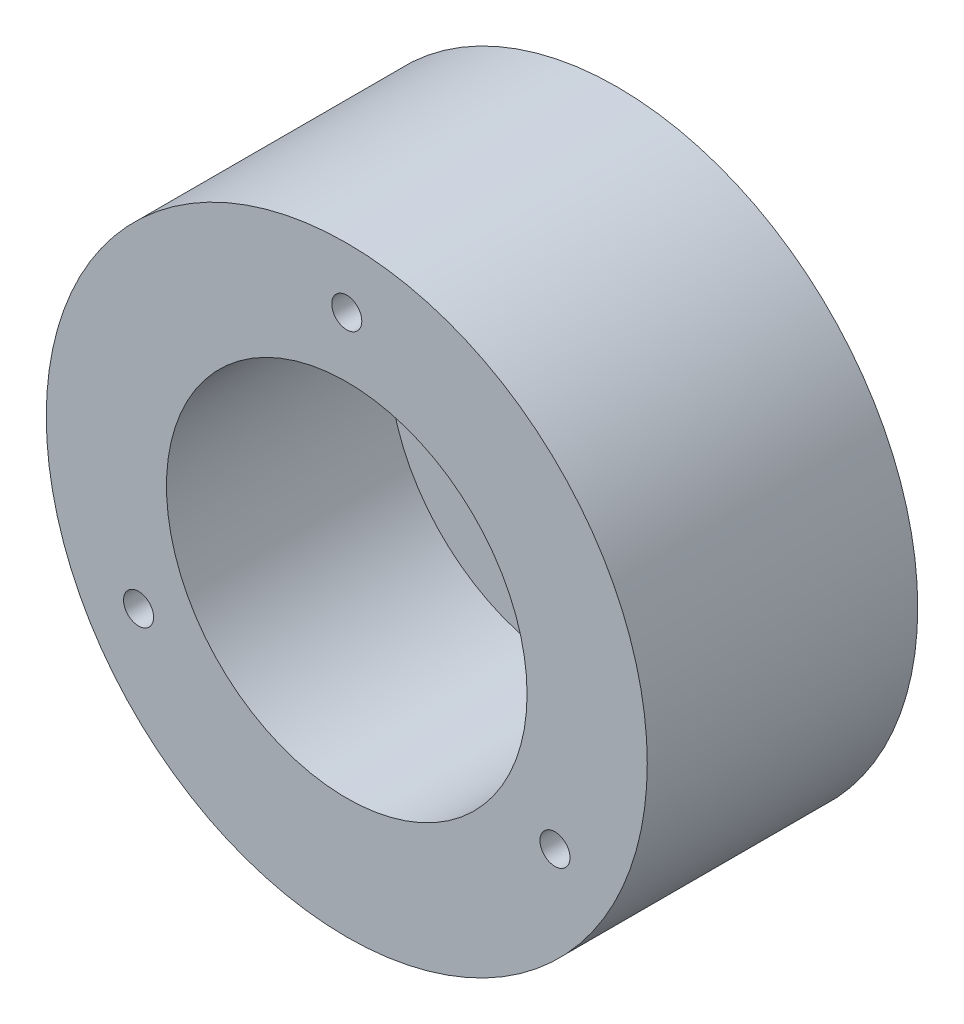
ISO-10303-21;
HEADER;
FILE_DESCRIPTION(('STEP AP214'),'2;1');
FILE_NAME('part.step','',(''),(''),'','','');
FILE_SCHEMA(('AUTOMOTIVE_DESIGN { 1 0 10303 214 1 1 1 1 }'));
ENDSEC;
DATA;
#1=APPLICATION_CONTEXT('core data for automotive mechanical design processes');
#2=APPLICATION_PROTOCOL_DEFINITION('international standard','automotive_design',2000,#1);
#3=PRODUCT_CONTEXT('',#1,'mechanical');
#4=PRODUCT('Part','Part','',(#3));
#5=PRODUCT_RELATED_PRODUCT_CATEGORY('part','',(#4));
#6=PRODUCT_DEFINITION_FORMATION('','',#4);
#7=PRODUCT_DEFINITION_CONTEXT('part definition',#1,'design');
#8=PRODUCT_DEFINITION('design','',#6,#7);
#9=PRODUCT_DEFINITION_SHAPE('','',#8);
#10=(LENGTH_UNIT() NAMED_UNIT(*) SI_UNIT(.MILLI.,.METRE.));
#11=(NAMED_UNIT(*) PLANE_ANGLE_UNIT() SI_UNIT($,.RADIAN.));
#12=(NAMED_UNIT(*) SI_UNIT($,.STERADIAN.) SOLID_ANGLE_UNIT());
#13=UNCERTAINTY_MEASURE_WITH_UNIT(LENGTH_MEASURE(1.E-05),#10,'distance_accuracy_value','');
#14=(GEOMETRIC_REPRESENTATION_CONTEXT(3) GLOBAL_UNCERTAINTY_ASSIGNED_CONTEXT((#13)) GLOBAL_UNIT_ASSIGNED_CONTEXT((#10,
#11,#12)) REPRESENTATION_CONTEXT('',''));
#15=CARTESIAN_POINT('',(0.,0.,0.));
#16=DIRECTION('',(0.,0.,1.));
#17=DIRECTION('',(1.,0.,0.));
#18=AXIS2_PLACEMENT_3D('',#15,#16,#17);
#19=CARTESIAN_POINT('',(0.,0.,8.));
#20=DIRECTION('',(0.,0.,1.));
#21=DIRECTION('',(1.,0.,0.));
#22=AXIS2_PLACEMENT_3D('',#19,#20,#21);
#23=PLANE('',#22);
#24=CARTESIAN_POINT('',(-20.,2.09488880330588E-13,8.));
#25=DIRECTION('',(0.,0.,1.));
#26=DIRECTION('',(1.,0.,0.));
#27=AXIS2_PLACEMENT_3D('',#24,#25,#26);
#28=CIRCLE('',#27,2.5);
#29=CARTESIAN_POINT('',(-17.5,2.09488880330588E-13,8.));
#30=VERTEX_POINT('',#29);
#31=EDGE_CURVE('E92',#30,#30,#28,.T.);
#32=ORIENTED_EDGE('',*,*,#31,.F.);
#33=EDGE_LOOP('',(#32));
#34=FACE_BOUND('',#33,.T.);
#35=CARTESIAN_POINT('',(-1.39659253553725E-13,-20.,8.));
#36=DIRECTION('',(0.,0.,1.));
#37=DIRECTION('',(1.,0.,0.));
#38=AXIS2_PLACEMENT_3D('',#35,#36,#37);
#39=CIRCLE('',#38,2.5);
#40=CARTESIAN_POINT('',(2.49999999999986,-20.,8.));
#41=VERTEX_POINT('',#40);
#42=EDGE_CURVE('E86',#41,#41,#39,.T.);
#43=ORIENTED_EDGE('',*,*,#42,.F.);
#44=EDGE_LOOP('',(#43));
#45=FACE_BOUND('',#44,.T.);
#46=CARTESIAN_POINT('',(20.,0.,8.));
#47=DIRECTION('',(0.,0.,1.));
#48=DIRECTION('',(1.,0.,0.));
#49=AXIS2_PLACEMENT_3D('',#46,#47,#48);
#50=CIRCLE('',#49,2.5);
#51=CARTESIAN_POINT('',(22.5,0.,8.));
#52=VERTEX_POINT('',#51);
#53=EDGE_CURVE('E80',#52,#52,#50,.T.);
#54=ORIENTED_EDGE('',*,*,#53,.F.);
#55=EDGE_LOOP('',(#54));
#56=FACE_BOUND('',#55,.T.);
#57=CARTESIAN_POINT('',(0.,20.,8.));
#58=DIRECTION('',(0.,0.,1.));
#59=DIRECTION('',(1.,0.,0.));
#60=AXIS2_PLACEMENT_3D('',#57,#58,#59);
#61=CIRCLE('',#60,2.5);
#62=CARTESIAN_POINT('',(2.5,20.,8.));
#63=VERTEX_POINT('',#62);
#64=EDGE_CURVE('E74',#63,#63,#61,.T.);
#65=ORIENTED_EDGE('',*,*,#64,.F.);
#66=EDGE_LOOP('',(#65));
#67=FACE_BOUND('',#66,.T.);
#68=CARTESIAN_POINT('',(0.,0.,8.00000000000001));
#69=DIRECTION('',(0.,0.,1.));
#70=DIRECTION('',(1.,0.,0.));
#71=AXIS2_PLACEMENT_3D('',#68,#69,#70);
#72=CIRCLE('',#71,30.);
#73=CARTESIAN_POINT('',(30.,0.,8.00000000000001));
#74=VERTEX_POINT('',#73);
#75=EDGE_CURVE('E10',#74,#74,#72,.F.);
#76=ORIENTED_EDGE('',*,*,#75,.F.);
#77=EDGE_LOOP('',(#76));
#78=FACE_BOUND('',#77,.T.);
#79=CARTESIAN_POINT('',(0.,0.,8.));
#80=DIRECTION('',(0.,0.,1.));
#81=DIRECTION('',(1.,0.,0.));
#82=AXIS2_PLACEMENT_3D('',#79,#80,#81);
#83=CIRCLE('',#82,16.);
#84=CARTESIAN_POINT('',(16.,0.,8.));
#85=VERTEX_POINT('',#84);
#86=EDGE_CURVE('E40',#85,#85,#83,.T.);
#87=ORIENTED_EDGE('',*,*,#86,.F.);
#88=EDGE_LOOP('',(#87));
#89=FACE_BOUND('',#88,.T.);
#90=ADVANCED_FACE('F29',(#34,#45,#56,#67,#78,#89),#23,.T.);
#91=CARTESIAN_POINT('',(0.,0.,0.));
#92=DIRECTION('',(0.,0.,1.));
#93=DIRECTION('',(1.,0.,0.));
#94=AXIS2_PLACEMENT_3D('',#91,#92,#93);
#95=PLANE('',#94);
#96=CARTESIAN_POINT('',(-20.,2.09488880330588E-13,0.));
#97=DIRECTION('',(0.,0.,1.));
#98=DIRECTION('',(1.,0.,0.));
#99=AXIS2_PLACEMENT_3D('',#96,#97,#98);
#100=CIRCLE('',#99,2.5);
#101=CARTESIAN_POINT('',(-17.5,2.09488880330588E-13,0.));
#102=VERTEX_POINT('',#101);
#103=EDGE_CURVE('E89',#102,#102,#100,.T.);
#104=ORIENTED_EDGE('',*,*,#103,.T.);
#105=EDGE_LOOP('',(#104));
#106=FACE_BOUND('',#105,.T.);
#107=CARTESIAN_POINT('',(-1.39659253553725E-13,-20.,0.));
#108=DIRECTION('',(0.,0.,1.));
#109=DIRECTION('',(1.,0.,0.));
#110=AXIS2_PLACEMENT_3D('',#107,#108,#109);
#111=CIRCLE('',#110,2.5);
#112=CARTESIAN_POINT('',(2.49999999999986,-20.,0.));
#113=VERTEX_POINT('',#112);
#114=EDGE_CURVE('E83',#113,#113,#111,.T.);
#115=ORIENTED_EDGE('',*,*,#114,.T.);
#116=EDGE_LOOP('',(#115));
#117=FACE_BOUND('',#116,.T.);
#118=CARTESIAN_POINT('',(20.,0.,0.));
#119=DIRECTION('',(0.,0.,1.));
#120=DIRECTION('',(1.,0.,0.));
#121=AXIS2_PLACEMENT_3D('',#118,#119,#120);
#122=CIRCLE('',#121,2.5);
#123=CARTESIAN_POINT('',(22.5,0.,0.));
#124=VERTEX_POINT('',#123);
#125=EDGE_CURVE('E77',#124,#124,#122,.T.);
#126=ORIENTED_EDGE('',*,*,#125,.T.);
#127=EDGE_LOOP('',(#126));
#128=FACE_BOUND('',#127,.T.);
#129=CARTESIAN_POINT('',(0.,20.,0.));
#130=DIRECTION('',(0.,0.,1.));
#131=DIRECTION('',(1.,0.,0.));
#132=AXIS2_PLACEMENT_3D('',#129,#130,#131);
#133=CIRCLE('',#132,2.5);
#134=CARTESIAN_POINT('',(2.5,20.,0.));
#135=VERTEX_POINT('',#134);
#136=EDGE_CURVE('E71',#135,#135,#133,.T.);
#137=ORIENTED_EDGE('',*,*,#136,.T.);
#138=EDGE_LOOP('',(#137));
#139=FACE_BOUND('',#138,.T.);
#140=CARTESIAN_POINT('',(-34.6410161513777,-19.9999999999997,0.));
#141=DIRECTION('',(0.,0.,1.));
#142=DIRECTION('',(1.,0.,0.));
#143=AXIS2_PLACEMENT_3D('',#140,#141,#142);
#144=CIRCLE('',#143,2.5);
#145=CARTESIAN_POINT('',(-32.1410161513777,-19.9999999999997,0.));
#146=VERTEX_POINT('',#145);
#147=EDGE_CURVE('E65',#146,#146,#144,.T.);
#148=ORIENTED_EDGE('',*,*,#147,.T.);
#149=EDGE_LOOP('',(#148));
#150=FACE_BOUND('',#149,.T.);
#151=CARTESIAN_POINT('',(34.6410161513775,-20.0000000000002,0.));
#152=DIRECTION('',(0.,0.,1.));
#153=DIRECTION('',(1.,0.,0.));
#154=AXIS2_PLACEMENT_3D('',#151,#152,#153);
#155=CIRCLE('',#154,2.5);
#156=CARTESIAN_POINT('',(37.1410161513775,-20.0000000000002,0.));
#157=VERTEX_POINT('',#156);
#158=EDGE_CURVE('E59',#157,#157,#155,.T.);
#159=ORIENTED_EDGE('',*,*,#158,.T.);
#160=EDGE_LOOP('',(#159));
#161=FACE_BOUND('',#160,.T.);
#162=CARTESIAN_POINT('',(0.,40.,0.));
#163=DIRECTION('',(0.,0.,1.));
#164=DIRECTION('',(1.,0.,0.));
#165=AXIS2_PLACEMENT_3D('',#162,#163,#164);
#166=CIRCLE('',#165,2.5);
#167=CARTESIAN_POINT('',(2.5,40.,0.));
#168=VERTEX_POINT('',#167);
#169=EDGE_CURVE('E53',#168,#168,#166,.T.);
#170=ORIENTED_EDGE('',*,*,#169,.T.);
#171=EDGE_LOOP('',(#170));
#172=FACE_BOUND('',#171,.T.);
#173=CARTESIAN_POINT('',(0.,0.,0.));
#174=DIRECTION('',(0.,0.,1.));
#175=DIRECTION('',(1.,0.,0.));
#176=AXIS2_PLACEMENT_3D('',#173,#174,#175);
#177=CIRCLE('',#176,50.);
#178=CARTESIAN_POINT('',(50.,0.,0.));
#179=VERTEX_POINT('',#178);
#180=EDGE_CURVE('E36',#179,#179,#177,.T.);
#181=ORIENTED_EDGE('',*,*,#180,.F.);
#182=EDGE_LOOP('',(#181));
#183=FACE_BOUND('',#182,.T.);
#184=CARTESIAN_POINT('',(0.,0.,0.));
#185=DIRECTION('',(0.,0.,1.));
#186=DIRECTION('',(1.,0.,0.));
#187=AXIS2_PLACEMENT_3D('',#184,#185,#186);
#188=CIRCLE('',#187,16.);
#189=CARTESIAN_POINT('',(16.,0.,0.));
#190=VERTEX_POINT('',#189);
#191=EDGE_CURVE('E44',#190,#190,#188,.T.);
#192=ORIENTED_EDGE('',*,*,#191,.T.);
#193=EDGE_LOOP('',(#192));
#194=FACE_BOUND('',#193,.T.);
#195=ADVANCED_FACE('F98',(#106,#117,#128,#139,#150,#161,#172,#183,#194),#95,.F.);
#196=CARTESIAN_POINT('',(0.,0.,8.));
#197=DIRECTION('',(0.,0.,-1.));
#198=DIRECTION('',(-1.,0.,0.));
#199=AXIS2_PLACEMENT_3D('',#196,#197,#198);
#200=CYLINDRICAL_SURFACE('',#199,50.);
#201=ORIENTED_EDGE('',*,*,#180,.T.);
#202=EDGE_LOOP('',(#201));
#203=FACE_BOUND('',#202,.T.);
#204=CARTESIAN_POINT('',(0.,0.,45.));
#205=DIRECTION('',(0.,0.,1.));
#206=DIRECTION('',(1.,0.,0.));
#207=AXIS2_PLACEMENT_3D('',#204,#205,#206);
#208=CIRCLE('',#207,50.);
#209=CARTESIAN_POINT('',(50.,0.,45.));
#210=VERTEX_POINT('',#209);
#211=EDGE_CURVE('E48',#210,#210,#208,.T.);
#212=ORIENTED_EDGE('',*,*,#211,.F.);
#213=EDGE_LOOP('',(#212));
#214=FACE_BOUND('',#213,.T.);
#215=ADVANCED_FACE('F31',(#203,#214),#200,.T.);
#216=CARTESIAN_POINT('',(0.,0.,8.));
#217=DIRECTION('',(0.,0.,-1.));
#218=DIRECTION('',(-1.,0.,0.));
#219=AXIS2_PLACEMENT_3D('',#216,#217,#218);
#220=CYLINDRICAL_SURFACE('',#219,16.);
#221=ORIENTED_EDGE('',*,*,#86,.T.);
#222=EDGE_LOOP('',(#221));
#223=FACE_BOUND('',#222,.T.);
#224=ORIENTED_EDGE('',*,*,#191,.F.);
#225=EDGE_LOOP('',(#224));
#226=FACE_BOUND('',#225,.T.);
#227=ADVANCED_FACE('F120',(#223,#226),#220,.F.);
#228=CARTESIAN_POINT('',(0.,0.,186.42135623731));
#229=DIRECTION('',(0.,0.,-1.));
#230=DIRECTION('',(-1.,0.,0.));
#231=AXIS2_PLACEMENT_3D('',#228,#229,#230);
#232=CYLINDRICAL_SURFACE('',#231,30.);
#233=ORIENTED_EDGE('',*,*,#75,.T.);
#234=EDGE_LOOP('',(#233));
#235=FACE_BOUND('',#234,.T.);
#236=CARTESIAN_POINT('',(0.,0.,45.));
#237=DIRECTION('',(0.,0.,1.));
#238=DIRECTION('',(1.,0.,0.));
#239=AXIS2_PLACEMENT_3D('',#236,#237,#238);
#240=CIRCLE('',#239,30.);
#241=CARTESIAN_POINT('',(30.,0.,45.));
#242=VERTEX_POINT('',#241);
#243=EDGE_CURVE('E50',#242,#242,#240,.T.);
#244=ORIENTED_EDGE('',*,*,#243,.T.);
#245=EDGE_LOOP('',(#244));
#246=FACE_BOUND('',#245,.T.);
#247=ADVANCED_FACE('F123',(#235,#246),#232,.F.);
#248=CARTESIAN_POINT('',(0.,0.,45.));
#249=DIRECTION('',(0.,0.,1.));
#250=DIRECTION('',(1.,0.,0.));
#251=AXIS2_PLACEMENT_3D('',#248,#249,#250);
#252=PLANE('',#251);
#253=CARTESIAN_POINT('',(-34.6410161513777,-19.9999999999997,45.));
#254=DIRECTION('',(0.,0.,1.));
#255=DIRECTION('',(1.,0.,0.));
#256=AXIS2_PLACEMENT_3D('',#253,#254,#255);
#257=CIRCLE('',#256,2.5);
#258=CARTESIAN_POINT('',(-32.1410161513777,-19.9999999999997,45.));
#259=VERTEX_POINT('',#258);
#260=EDGE_CURVE('E68',#259,#259,#257,.T.);
#261=ORIENTED_EDGE('',*,*,#260,.F.);
#262=EDGE_LOOP('',(#261));
#263=FACE_BOUND('',#262,.T.);
#264=CARTESIAN_POINT('',(34.6410161513775,-20.0000000000002,45.));
#265=DIRECTION('',(0.,0.,1.));
#266=DIRECTION('',(1.,0.,0.));
#267=AXIS2_PLACEMENT_3D('',#264,#265,#266);
#268=CIRCLE('',#267,2.5);
#269=CARTESIAN_POINT('',(37.1410161513775,-20.0000000000002,45.));
#270=VERTEX_POINT('',#269);
#271=EDGE_CURVE('E62',#270,#270,#268,.T.);
#272=ORIENTED_EDGE('',*,*,#271,.F.);
#273=EDGE_LOOP('',(#272));
#274=FACE_BOUND('',#273,.T.);
#275=CARTESIAN_POINT('',(0.,40.,45.));
#276=DIRECTION('',(0.,0.,1.));
#277=DIRECTION('',(1.,0.,0.));
#278=AXIS2_PLACEMENT_3D('',#275,#276,#277);
#279=CIRCLE('',#278,2.5);
#280=CARTESIAN_POINT('',(2.5,40.,45.));
#281=VERTEX_POINT('',#280);
#282=EDGE_CURVE('E56',#281,#281,#279,.T.);
#283=ORIENTED_EDGE('',*,*,#282,.F.);
#284=EDGE_LOOP('',(#283));
#285=FACE_BOUND('',#284,.T.);
#286=ORIENTED_EDGE('',*,*,#243,.F.);
#287=EDGE_LOOP('',(#286));
#288=FACE_BOUND('',#287,.T.);
#289=ORIENTED_EDGE('',*,*,#211,.T.);
#290=EDGE_LOOP('',(#289));
#291=FACE_BOUND('',#290,.T.);
#292=ADVANCED_FACE('F134',(#263,#274,#285,#288,#291),#252,.T.);
#293=CARTESIAN_POINT('',(0.,40.,0.));
#294=DIRECTION('',(0.,0.,1.));
#295=DIRECTION('',(1.,0.,0.));
#296=AXIS2_PLACEMENT_3D('',#293,#294,#295);
#297=CYLINDRICAL_SURFACE('',#296,2.5);
#298=ORIENTED_EDGE('',*,*,#169,.F.);
#299=EDGE_LOOP('',(#298));
#300=FACE_BOUND('',#299,.T.);
#301=ORIENTED_EDGE('',*,*,#282,.T.);
#302=EDGE_LOOP('',(#301));
#303=FACE_BOUND('',#302,.T.);
#304=ADVANCED_FACE('F137',(#300,#303),#297,.F.);
#305=CARTESIAN_POINT('',(34.6410161513775,-20.0000000000002,0.));
#306=DIRECTION('',(0.,0.,1.));
#307=DIRECTION('',(1.,0.,0.));
#308=AXIS2_PLACEMENT_3D('',#305,#306,#307);
#309=CYLINDRICAL_SURFACE('',#308,2.5);
#310=ORIENTED_EDGE('',*,*,#158,.F.);
#311=EDGE_LOOP('',(#310));
#312=FACE_BOUND('',#311,.T.);
#313=ORIENTED_EDGE('',*,*,#271,.T.);
#314=EDGE_LOOP('',(#313));
#315=FACE_BOUND('',#314,.T.);
#316=ADVANCED_FACE('F141',(#312,#315),#309,.F.);
#317=CARTESIAN_POINT('',(-34.6410161513777,-19.9999999999997,0.));
#318=DIRECTION('',(0.,0.,1.));
#319=DIRECTION('',(1.,0.,0.));
#320=AXIS2_PLACEMENT_3D('',#317,#318,#319);
#321=CYLINDRICAL_SURFACE('',#320,2.5);
#322=ORIENTED_EDGE('',*,*,#147,.F.);
#323=EDGE_LOOP('',(#322));
#324=FACE_BOUND('',#323,.T.);
#325=ORIENTED_EDGE('',*,*,#260,.T.);
#326=EDGE_LOOP('',(#325));
#327=FACE_BOUND('',#326,.T.);
#328=ADVANCED_FACE('F145',(#324,#327),#321,.F.);
#329=CARTESIAN_POINT('',(0.,20.,0.));
#330=DIRECTION('',(0.,0.,1.));
#331=DIRECTION('',(1.,0.,0.));
#332=AXIS2_PLACEMENT_3D('',#329,#330,#331);
#333=CYLINDRICAL_SURFACE('',#332,2.5);
#334=ORIENTED_EDGE('',*,*,#136,.F.);
#335=EDGE_LOOP('',(#334));
#336=FACE_BOUND('',#335,.T.);
#337=ORIENTED_EDGE('',*,*,#64,.T.);
#338=EDGE_LOOP('',(#337));
#339=FACE_BOUND('',#338,.T.);
#340=ADVANCED_FACE('F149',(#336,#339),#333,.F.);
#341=CARTESIAN_POINT('',(20.,0.,0.));
#342=DIRECTION('',(0.,0.,1.));
#343=DIRECTION('',(1.,0.,0.));
#344=AXIS2_PLACEMENT_3D('',#341,#342,#343);
#345=CYLINDRICAL_SURFACE('',#344,2.5);
#346=ORIENTED_EDGE('',*,*,#125,.F.);
#347=EDGE_LOOP('',(#346));
#348=FACE_BOUND('',#347,.T.);
#349=ORIENTED_EDGE('',*,*,#53,.T.);
#350=EDGE_LOOP('',(#349));
#351=FACE_BOUND('',#350,.T.);
#352=ADVANCED_FACE('F153',(#348,#351),#345,.F.);
#353=CARTESIAN_POINT('',(-1.39659253553725E-13,-20.,0.));
#354=DIRECTION('',(0.,0.,1.));
#355=DIRECTION('',(1.,0.,0.));
#356=AXIS2_PLACEMENT_3D('',#353,#354,#355);
#357=CYLINDRICAL_SURFACE('',#356,2.5);
#358=ORIENTED_EDGE('',*,*,#114,.F.);
#359=EDGE_LOOP('',(#358));
#360=FACE_BOUND('',#359,.T.);
#361=ORIENTED_EDGE('',*,*,#42,.T.);
#362=EDGE_LOOP('',(#361));
#363=FACE_BOUND('',#362,.T.);
#364=ADVANCED_FACE('F104',(#360,#363),#357,.F.);
#365=CARTESIAN_POINT('',(-20.,2.09488880330588E-13,0.));
#366=DIRECTION('',(0.,0.,1.));
#367=DIRECTION('',(1.,0.,0.));
#368=AXIS2_PLACEMENT_3D('',#365,#366,#367);
#369=CYLINDRICAL_SURFACE('',#368,2.5);
#370=ORIENTED_EDGE('',*,*,#103,.F.);
#371=EDGE_LOOP('',(#370));
#372=FACE_BOUND('',#371,.T.);
#373=ORIENTED_EDGE('',*,*,#31,.T.);
#374=EDGE_LOOP('',(#373));
#375=FACE_BOUND('',#374,.T.);
#376=ADVANCED_FACE('F101',(#372,#375),#369,.F.);
#377=CLOSED_SHELL('',(#90,#195,#215,#227,#247,#292,#304,#316,#328,#340,#352,#364,#376));
#378=MANIFOLD_SOLID_BREP('B2',#377);
#379=ADVANCED_BREP_SHAPE_REPRESENTATION('',(#18,#378),#14);
#380=SHAPE_DEFINITION_REPRESENTATION(#9,#379);
ENDSEC;
END-ISO-10303-21;
